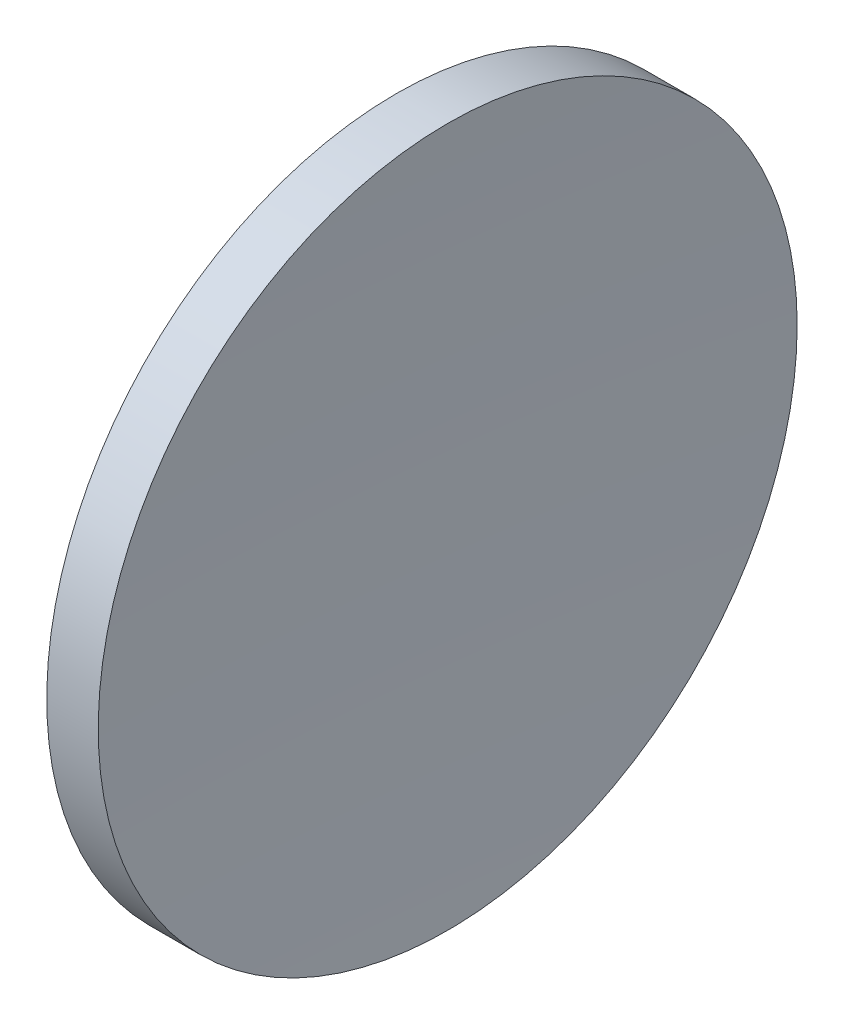
ISO-10303-21;
HEADER;
FILE_DESCRIPTION(('STEP AP214'),'2;1');
FILE_NAME('part.step','',(''),(''),'','','');
FILE_SCHEMA(('AUTOMOTIVE_DESIGN { 1 0 10303 214 1 1 1 1 }'));
ENDSEC;
DATA;
#1=APPLICATION_CONTEXT('core data for automotive mechanical design processes');
#2=APPLICATION_PROTOCOL_DEFINITION('international standard','automotive_design',2000,#1);
#3=PRODUCT_CONTEXT('',#1,'mechanical');
#4=PRODUCT('Part','Part','',(#3));
#5=PRODUCT_RELATED_PRODUCT_CATEGORY('part','',(#4));
#6=PRODUCT_DEFINITION_FORMATION('','',#4);
#7=PRODUCT_DEFINITION_CONTEXT('part definition',#1,'design');
#8=PRODUCT_DEFINITION('design','',#6,#7);
#9=PRODUCT_DEFINITION_SHAPE('','',#8);
#10=(LENGTH_UNIT() NAMED_UNIT(*) SI_UNIT(.MILLI.,.METRE.));
#11=(NAMED_UNIT(*) PLANE_ANGLE_UNIT() SI_UNIT($,.RADIAN.));
#12=(NAMED_UNIT(*) SI_UNIT($,.STERADIAN.) SOLID_ANGLE_UNIT());
#13=UNCERTAINTY_MEASURE_WITH_UNIT(LENGTH_MEASURE(1.E-05),#10,'distance_accuracy_value','');
#14=(GEOMETRIC_REPRESENTATION_CONTEXT(3) GLOBAL_UNCERTAINTY_ASSIGNED_CONTEXT((#13)) GLOBAL_UNIT_ASSIGNED_CONTEXT((#10,
#11,#12)) REPRESENTATION_CONTEXT('',''));
#15=CARTESIAN_POINT('',(0.,0.,0.));
#16=DIRECTION('',(0.,0.,1.));
#17=DIRECTION('',(1.,0.,0.));
#18=AXIS2_PLACEMENT_3D('',#15,#16,#17);
#19=CARTESIAN_POINT('',(431.145520155767,34.5168962409161,22.1552279145953));
#20=DIRECTION('',(1.,0.,0.));
#21=DIRECTION('',(0.,1.,0.));
#22=AXIS2_PLACEMENT_3D('',#19,#20,#21);
#23=SPHERICAL_SURFACE('',#22,515.7);
#24=CARTESIAN_POINT('',(-83.9285813092556,34.5168962409161,22.1552279145953));
#25=DIRECTION('',(1.,0.,0.));
#26=DIRECTION('',(0.,0.,-1.));
#27=AXIS2_PLACEMENT_3D('',#24,#25,#26);
#28=CIRCLE('',#27,25.4);
#29=CARTESIAN_POINT('',(-83.9285813092556,34.5168962409161,-3.24477208540466));
#30=VERTEX_POINT('',#29);
#31=EDGE_CURVE('E8',#30,#30,#28,.T.);
#32=ORIENTED_EDGE('',*,*,#31,.T.);
#33=EDGE_LOOP('',(#32));
#34=FACE_BOUND('',#33,.T.);
#35=ADVANCED_FACE('F13',(#34),#23,.F.);
#36=CARTESIAN_POINT('',(-84.5544798442333,34.5168962409161,22.1552279145953));
#37=DIRECTION('',(1.,0.,0.));
#38=DIRECTION('',(0.,0.,-1.));
#39=AXIS2_PLACEMENT_3D('',#36,#37,#38);
#40=CYLINDRICAL_SURFACE('',#39,25.4);
#41=CARTESIAN_POINT('',(-87.6719965495298,34.5168962409161,22.1552279145953));
#42=DIRECTION('',(1.,0.,0.));
#43=DIRECTION('',(0.,0.,-1.));
#44=AXIS2_PLACEMENT_3D('',#41,#42,#43);
#45=CIRCLE('',#44,25.4);
#46=CARTESIAN_POINT('',(-87.6719965495298,34.5168962409161,-3.24477208540469));
#47=VERTEX_POINT('',#46);
#48=EDGE_CURVE('E19',#47,#47,#45,.T.);
#49=ORIENTED_EDGE('',*,*,#48,.T.);
#50=EDGE_LOOP('',(#49));
#51=FACE_BOUND('',#50,.T.);
#52=ORIENTED_EDGE('',*,*,#31,.F.);
#53=EDGE_LOOP('',(#52));
#54=FACE_BOUND('',#53,.T.);
#55=ADVANCED_FACE('F25',(#51,#54),#40,.T.);
#56=CARTESIAN_POINT('',(82.7455201557667,34.5168962409161,22.1552279145953));
#57=DIRECTION('',(1.,0.,0.));
#58=DIRECTION('',(0.,1.,0.));
#59=AXIS2_PLACEMENT_3D('',#56,#57,#58);
#60=SPHERICAL_SURFACE('',#59,172.3);
#61=ORIENTED_EDGE('',*,*,#48,.F.);
#62=EDGE_LOOP('',(#61));
#63=FACE_BOUND('',#62,.T.);
#64=ADVANCED_FACE('F28',(#63),#60,.T.);
#65=CLOSED_SHELL('',(#35,#55,#64));
#66=MANIFOLD_SOLID_BREP('B1',#65);
#67=ADVANCED_BREP_SHAPE_REPRESENTATION('',(#18,#66),#14);
#68=SHAPE_DEFINITION_REPRESENTATION(#9,#67);
ENDSEC;
END-ISO-10303-21;
